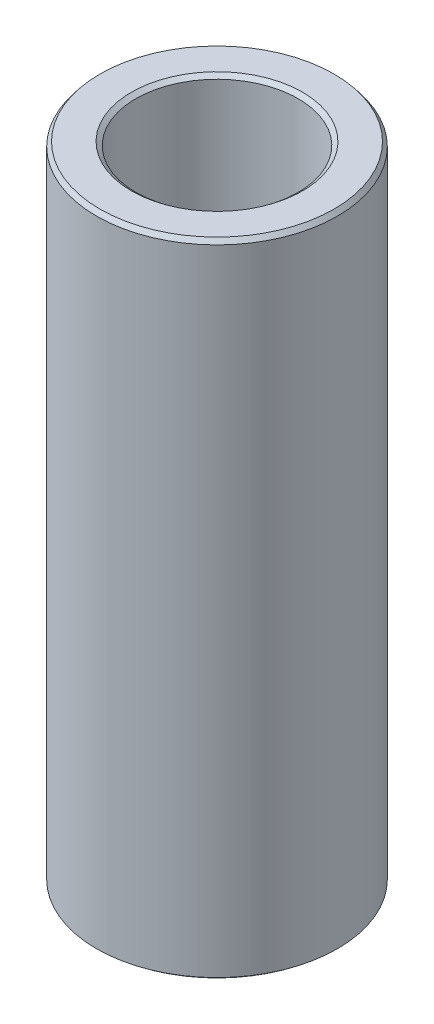
ISO-10303-21;
HEADER;
FILE_DESCRIPTION(('STEP AP214'),'2;1');
FILE_NAME('part.step','',(''),(''),'','','');
FILE_SCHEMA(('AUTOMOTIVE_DESIGN { 1 0 10303 214 1 1 1 1 }'));
ENDSEC;
DATA;
#1=APPLICATION_CONTEXT('core data for automotive mechanical design processes');
#2=APPLICATION_PROTOCOL_DEFINITION('international standard','automotive_design',2000,#1);
#3=PRODUCT_CONTEXT('',#1,'mechanical');
#4=PRODUCT('Part','Part','',(#3));
#5=PRODUCT_RELATED_PRODUCT_CATEGORY('part','',(#4));
#6=PRODUCT_DEFINITION_FORMATION('','',#4);
#7=PRODUCT_DEFINITION_CONTEXT('part definition',#1,'design');
#8=PRODUCT_DEFINITION('design','',#6,#7);
#9=PRODUCT_DEFINITION_SHAPE('','',#8);
#10=(LENGTH_UNIT() NAMED_UNIT(*) SI_UNIT(.MILLI.,.METRE.));
#11=(NAMED_UNIT(*) PLANE_ANGLE_UNIT() SI_UNIT($,.RADIAN.));
#12=(NAMED_UNIT(*) SI_UNIT($,.STERADIAN.) SOLID_ANGLE_UNIT());
#13=UNCERTAINTY_MEASURE_WITH_UNIT(LENGTH_MEASURE(1.E-05),#10,'distance_accuracy_value','');
#14=(GEOMETRIC_REPRESENTATION_CONTEXT(3) GLOBAL_UNCERTAINTY_ASSIGNED_CONTEXT((#13)) GLOBAL_UNIT_ASSIGNED_CONTEXT((#10,
#11,#12)) REPRESENTATION_CONTEXT('',''));
#15=CARTESIAN_POINT('',(0.,0.,0.));
#16=DIRECTION('',(0.,0.,1.));
#17=DIRECTION('',(1.,0.,0.));
#18=AXIS2_PLACEMENT_3D('',#15,#16,#17);
#19=CARTESIAN_POINT('',(0.,39.9931636423642,0.));
#20=DIRECTION('',(0.,-1.,0.));
#21=DIRECTION('',(0.,0.,-1.));
#22=AXIS2_PLACEMENT_3D('',#19,#20,#21);
#23=CYLINDRICAL_SURFACE('',#22,7.5);
#24=CARTESIAN_POINT('',(0.,0.213018416823058,0.));
#25=DIRECTION('',(0.,1.,0.));
#26=DIRECTION('',(0.,0.,1.));
#27=AXIS2_PLACEMENT_3D('',#24,#25,#26);
#28=CIRCLE('',#27,7.5);
#29=CARTESIAN_POINT('',(0.,0.213018416823058,7.5));
#30=VERTEX_POINT('',#29);
#31=EDGE_CURVE('E10',#30,#30,#28,.T.);
#32=ORIENTED_EDGE('',*,*,#31,.T.);
#33=EDGE_LOOP('',(#32));
#34=FACE_BOUND('',#33,.T.);
#35=CARTESIAN_POINT('',(0.,39.721159949407,0.));
#36=DIRECTION('',(0.,1.,0.));
#37=DIRECTION('',(0.,0.,1.));
#38=AXIS2_PLACEMENT_3D('',#35,#36,#37);
#39=CIRCLE('',#38,7.5);
#40=CARTESIAN_POINT('',(0.,39.721159949407,7.5));
#41=VERTEX_POINT('',#40);
#42=EDGE_CURVE('E50',#41,#41,#39,.F.);
#43=ORIENTED_EDGE('',*,*,#42,.T.);
#44=EDGE_LOOP('',(#43));
#45=FACE_BOUND('',#44,.T.);
#46=ADVANCED_FACE('F39',(#34,#45),#23,.T.);
#47=CARTESIAN_POINT('',(0.,39.9931636423642,0.));
#48=DIRECTION('',(0.,1.,0.));
#49=DIRECTION('',(0.,0.,1.));
#50=AXIS2_PLACEMENT_3D('',#47,#48,#49);
#51=PLANE('',#50);
#52=CARTESIAN_POINT('',(0.,39.9931636423642,0.));
#53=DIRECTION('',(0.,1.,0.));
#54=DIRECTION('',(0.,0.,1.));
#55=AXIS2_PLACEMENT_3D('',#52,#53,#54);
#56=CIRCLE('',#55,5.32714375898222);
#57=CARTESIAN_POINT('',(0.,39.9931636423642,5.32714375898222));
#58=VERTEX_POINT('',#57);
#59=EDGE_CURVE('E58',#58,#58,#56,.F.);
#60=ORIENTED_EDGE('',*,*,#59,.T.);
#61=EDGE_LOOP('',(#60));
#62=FACE_BOUND('',#61,.T.);
#63=CARTESIAN_POINT('',(0.,39.9931636423642,0.));
#64=DIRECTION('',(0.,1.,0.));
#65=DIRECTION('',(0.,0.,1.));
#66=AXIS2_PLACEMENT_3D('',#63,#64,#65);
#67=CIRCLE('',#66,7.28698158317694);
#68=CARTESIAN_POINT('',(0.,39.9931636423642,7.28698158317694));
#69=VERTEX_POINT('',#68);
#70=EDGE_CURVE('E61',#69,#69,#67,.T.);
#71=ORIENTED_EDGE('',*,*,#70,.T.);
#72=EDGE_LOOP('',(#71));
#73=FACE_BOUND('',#72,.T.);
#74=ADVANCED_FACE('F88',(#62,#73),#51,.T.);
#75=CARTESIAN_POINT('',(0.,0.,0.));
#76=DIRECTION('',(0.,1.,0.));
#77=DIRECTION('',(0.,0.,1.));
#78=AXIS2_PLACEMENT_3D('',#75,#76,#77);
#79=PLANE('',#78);
#80=CARTESIAN_POINT('',(0.,0.,0.));
#81=DIRECTION('',(0.,1.,0.));
#82=DIRECTION('',(0.,0.,1.));
#83=AXIS2_PLACEMENT_3D('',#80,#81,#82);
#84=CIRCLE('',#83,5.26815848284801);
#85=CARTESIAN_POINT('',(0.,0.,5.26815848284801));
#86=VERTEX_POINT('',#85);
#87=EDGE_CURVE('E51',#86,#86,#84,.T.);
#88=ORIENTED_EDGE('',*,*,#87,.T.);
#89=EDGE_LOOP('',(#88));
#90=FACE_BOUND('',#89,.T.);
#91=CARTESIAN_POINT('',(0.,0.,0.));
#92=DIRECTION('',(0.,1.,0.));
#93=DIRECTION('',(0.,0.,1.));
#94=AXIS2_PLACEMENT_3D('',#91,#92,#93);
#95=CIRCLE('',#94,7.22799630704274);
#96=CARTESIAN_POINT('',(0.,0.,7.22799630704274));
#97=VERTEX_POINT('',#96);
#98=EDGE_CURVE('E54',#97,#97,#95,.F.);
#99=ORIENTED_EDGE('',*,*,#98,.T.);
#100=EDGE_LOOP('',(#99));
#101=FACE_BOUND('',#100,.T.);
#102=ADVANCED_FACE('F83',(#90,#101),#79,.F.);
#103=CARTESIAN_POINT('',(0.,39.9931636423642,0.));
#104=DIRECTION('',(0.,-1.,0.));
#105=DIRECTION('',(0.,0.,-1.));
#106=AXIS2_PLACEMENT_3D('',#103,#104,#105);
#107=CYLINDRICAL_SURFACE('',#106,5.05514006602495);
#108=CARTESIAN_POINT('',(0.,39.7801452255412,0.));
#109=DIRECTION('',(0.,1.,0.));
#110=DIRECTION('',(0.,0.,1.));
#111=AXIS2_PLACEMENT_3D('',#108,#109,#110);
#112=CIRCLE('',#111,5.05514006602495);
#113=CARTESIAN_POINT('',(0.,39.7801452255412,5.05514006602495));
#114=VERTEX_POINT('',#113);
#115=EDGE_CURVE('E67',#114,#114,#112,.T.);
#116=ORIENTED_EDGE('',*,*,#115,.T.);
#117=EDGE_LOOP('',(#116));
#118=FACE_BOUND('',#117,.T.);
#119=CARTESIAN_POINT('',(0.,0.272003692957254,0.));
#120=DIRECTION('',(0.,1.,0.));
#121=DIRECTION('',(0.,0.,1.));
#122=AXIS2_PLACEMENT_3D('',#119,#120,#121);
#123=CIRCLE('',#122,5.05514006602495);
#124=CARTESIAN_POINT('',(0.,0.272003692957254,5.05514006602495));
#125=VERTEX_POINT('',#124);
#126=EDGE_CURVE('E69',#125,#125,#123,.F.);
#127=ORIENTED_EDGE('',*,*,#126,.T.);
#128=EDGE_LOOP('',(#127));
#129=FACE_BOUND('',#128,.T.);
#130=ADVANCED_FACE('F71',(#118,#129),#107,.F.);
#131=CARTESIAN_POINT('',(0.,39.7801452255412,0.));
#132=DIRECTION('',(0.,1.,0.));
#133=DIRECTION('',(0.,0.,1.));
#134=AXIS2_PLACEMENT_3D('',#131,#132,#133);
#135=CONICAL_SURFACE('',#134,5.05514006602495,0.90641746079431);
#136=ORIENTED_EDGE('',*,*,#59,.F.);
#137=EDGE_LOOP('',(#136));
#138=FACE_BOUND('',#137,.T.);
#139=ORIENTED_EDGE('',*,*,#115,.F.);
#140=EDGE_LOOP('',(#139));
#141=FACE_BOUND('',#140,.T.);
#142=ADVANCED_FACE('F77',(#138,#141),#135,.F.);
#143=CARTESIAN_POINT('',(0.,0.,0.));
#144=DIRECTION('',(0.,-1.,0.));
#145=DIRECTION('',(0.,0.,-1.));
#146=AXIS2_PLACEMENT_3D('',#143,#144,#145);
#147=CONICAL_SURFACE('',#146,5.26815848284801,0.664378866000589);
#148=ORIENTED_EDGE('',*,*,#126,.F.);
#149=EDGE_LOOP('',(#148));
#150=FACE_BOUND('',#149,.T.);
#151=ORIENTED_EDGE('',*,*,#87,.F.);
#152=EDGE_LOOP('',(#151));
#153=FACE_BOUND('',#152,.T.);
#154=ADVANCED_FACE('F73',(#150,#153),#147,.F.);
#155=CARTESIAN_POINT('',(0.,0.213018416823058,0.));
#156=DIRECTION('',(0.,1.,0.));
#157=DIRECTION('',(0.,0.,1.));
#158=AXIS2_PLACEMENT_3D('',#155,#156,#157);
#159=CONICAL_SURFACE('',#158,7.5,0.90641746079432);
#160=ORIENTED_EDGE('',*,*,#98,.F.);
#161=EDGE_LOOP('',(#160));
#162=FACE_BOUND('',#161,.T.);
#163=ORIENTED_EDGE('',*,*,#31,.F.);
#164=EDGE_LOOP('',(#163));
#165=FACE_BOUND('',#164,.T.);
#166=ADVANCED_FACE('F76',(#162,#165),#159,.T.);
#167=CARTESIAN_POINT('',(0.,39.9931636423642,0.));
#168=DIRECTION('',(0.,-1.,0.));
#169=DIRECTION('',(0.,0.,-1.));
#170=AXIS2_PLACEMENT_3D('',#167,#168,#169);
#171=CONICAL_SURFACE('',#170,7.28698158317694,0.664378866000585);
#172=ORIENTED_EDGE('',*,*,#42,.F.);
#173=EDGE_LOOP('',(#172));
#174=FACE_BOUND('',#173,.T.);
#175=ORIENTED_EDGE('',*,*,#70,.F.);
#176=EDGE_LOOP('',(#175));
#177=FACE_BOUND('',#176,.T.);
#178=ADVANCED_FACE('F45',(#174,#177),#171,.T.);
#179=CLOSED_SHELL('',(#46,#74,#102,#130,#142,#154,#166,#178));
#180=MANIFOLD_SOLID_BREP('B2',#179);
#181=ADVANCED_BREP_SHAPE_REPRESENTATION('',(#18,#180),#14);
#182=SHAPE_DEFINITION_REPRESENTATION(#9,#181);
ENDSEC;
END-ISO-10303-21;
